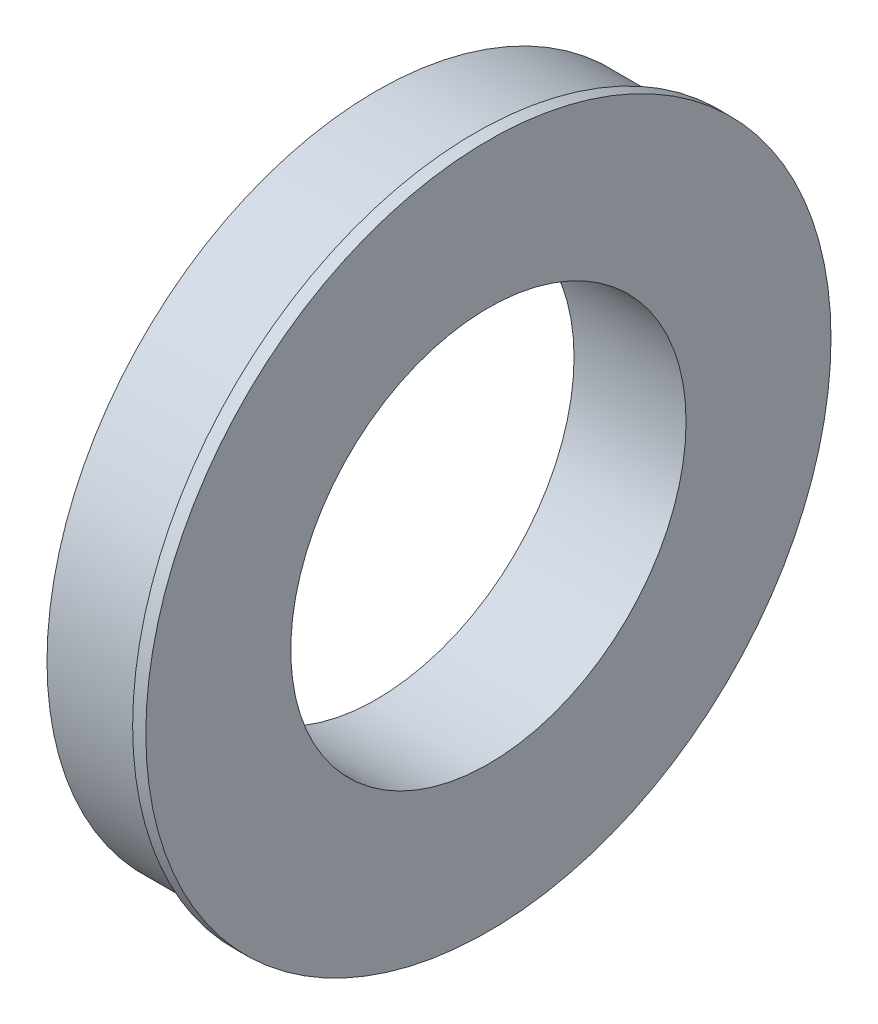
ISO-10303-21;
HEADER;
FILE_DESCRIPTION(('STEP AP214'),'2;1');
FILE_NAME('part.step','',(''),(''),'','','');
FILE_SCHEMA(('AUTOMOTIVE_DESIGN { 1 0 10303 214 1 1 1 1 }'));
ENDSEC;
DATA;
#1=APPLICATION_CONTEXT('core data for automotive mechanical design processes');
#2=APPLICATION_PROTOCOL_DEFINITION('international standard','automotive_design',2000,#1);
#3=PRODUCT_CONTEXT('',#1,'mechanical');
#4=PRODUCT('Part','Part','',(#3));
#5=PRODUCT_RELATED_PRODUCT_CATEGORY('part','',(#4));
#6=PRODUCT_DEFINITION_FORMATION('','',#4);
#7=PRODUCT_DEFINITION_CONTEXT('part definition',#1,'design');
#8=PRODUCT_DEFINITION('design','',#6,#7);
#9=PRODUCT_DEFINITION_SHAPE('','',#8);
#10=(LENGTH_UNIT() NAMED_UNIT(*) SI_UNIT(.MILLI.,.METRE.));
#11=(NAMED_UNIT(*) PLANE_ANGLE_UNIT() SI_UNIT($,.RADIAN.));
#12=(NAMED_UNIT(*) SI_UNIT($,.STERADIAN.) SOLID_ANGLE_UNIT());
#13=UNCERTAINTY_MEASURE_WITH_UNIT(LENGTH_MEASURE(1.E-05),#10,'distance_accuracy_value','');
#14=(GEOMETRIC_REPRESENTATION_CONTEXT(3) GLOBAL_UNCERTAINTY_ASSIGNED_CONTEXT((#13)) GLOBAL_UNIT_ASSIGNED_CONTEXT((#10,
#11,#12)) REPRESENTATION_CONTEXT('',''));
#15=CARTESIAN_POINT('',(0.,0.,0.));
#16=DIRECTION('',(0.,0.,1.));
#17=DIRECTION('',(1.,0.,0.));
#18=AXIS2_PLACEMENT_3D('',#15,#16,#17);
#19=CARTESIAN_POINT('',(0.,0.,0.));
#20=DIRECTION('',(1.,0.,0.));
#21=DIRECTION('',(0.,0.,-1.));
#22=AXIS2_PLACEMENT_3D('',#19,#20,#21);
#23=PLANE('',#22);
#24=CARTESIAN_POINT('',(0.,0.,0.));
#25=DIRECTION('',(1.,0.,0.));
#26=DIRECTION('',(0.,0.,-1.));
#27=AXIS2_PLACEMENT_3D('',#24,#25,#26);
#28=CIRCLE('',#27,63.5);
#29=CARTESIAN_POINT('',(0.,0.,-63.5));
#30=VERTEX_POINT('',#29);
#31=EDGE_CURVE('E45',#30,#30,#28,.T.);
#32=ORIENTED_EDGE('',*,*,#31,.F.);
#33=EDGE_LOOP('',(#32));
#34=FACE_BOUND('',#33,.T.);
#35=CARTESIAN_POINT('',(0.,0.,0.));
#36=DIRECTION('',(1.,0.,0.));
#37=DIRECTION('',(0.,0.,-1.));
#38=AXIS2_PLACEMENT_3D('',#35,#36,#37);
#39=CIRCLE('',#38,38.1);
#40=CARTESIAN_POINT('',(0.,0.,-38.1));
#41=VERTEX_POINT('',#40);
#42=EDGE_CURVE('E54',#41,#41,#39,.T.);
#43=ORIENTED_EDGE('',*,*,#42,.T.);
#44=EDGE_LOOP('',(#43));
#45=FACE_BOUND('',#44,.T.);
#46=ADVANCED_FACE('F41',(#34,#45),#23,.F.);
#47=CARTESIAN_POINT('',(19.05,0.,0.));
#48=DIRECTION('',(-1.,0.,0.));
#49=DIRECTION('',(0.,0.,1.));
#50=AXIS2_PLACEMENT_3D('',#47,#48,#49);
#51=CYLINDRICAL_SURFACE('',#50,63.5);
#52=CARTESIAN_POINT('',(19.05,0.,0.));
#53=DIRECTION('',(1.,0.,0.));
#54=DIRECTION('',(0.,0.,-1.));
#55=AXIS2_PLACEMENT_3D('',#52,#53,#54);
#56=CIRCLE('',#55,63.5);
#57=CARTESIAN_POINT('',(19.05,0.,-63.5));
#58=VERTEX_POINT('',#57);
#59=EDGE_CURVE('E10',#58,#58,#56,.T.);
#60=ORIENTED_EDGE('',*,*,#59,.F.);
#61=EDGE_LOOP('',(#60));
#62=FACE_BOUND('',#61,.T.);
#63=ORIENTED_EDGE('',*,*,#31,.T.);
#64=EDGE_LOOP('',(#63));
#65=FACE_BOUND('',#64,.T.);
#66=ADVANCED_FACE('F43',(#62,#65),#51,.T.);
#67=CARTESIAN_POINT('',(19.05,0.,0.));
#68=DIRECTION('',(-1.,0.,0.));
#69=DIRECTION('',(0.,0.,1.));
#70=AXIS2_PLACEMENT_3D('',#67,#68,#69);
#71=CYLINDRICAL_SURFACE('',#70,38.1);
#72=ORIENTED_EDGE('',*,*,#42,.F.);
#73=EDGE_LOOP('',(#72));
#74=FACE_BOUND('',#73,.T.);
#75=CARTESIAN_POINT('',(21.59,0.,0.));
#76=DIRECTION('',(1.,0.,0.));
#77=DIRECTION('',(0.,0.,-1.));
#78=AXIS2_PLACEMENT_3D('',#75,#76,#77);
#79=CIRCLE('',#78,38.1);
#80=CARTESIAN_POINT('',(21.59,0.,-38.1));
#81=VERTEX_POINT('',#80);
#82=EDGE_CURVE('E64',#81,#81,#79,.T.);
#83=ORIENTED_EDGE('',*,*,#82,.T.);
#84=EDGE_LOOP('',(#83));
#85=FACE_BOUND('',#84,.T.);
#86=ADVANCED_FACE('F72',(#74,#85),#71,.F.);
#87=CARTESIAN_POINT('',(21.59,0.,0.));
#88=DIRECTION('',(1.,0.,0.));
#89=DIRECTION('',(0.,0.,-1.));
#90=AXIS2_PLACEMENT_3D('',#87,#88,#89);
#91=PLANE('',#90);
#92=CARTESIAN_POINT('',(21.59,0.,0.));
#93=DIRECTION('',(1.,0.,0.));
#94=DIRECTION('',(0.,0.,-1.));
#95=AXIS2_PLACEMENT_3D('',#92,#93,#94);
#96=CIRCLE('',#95,66.04);
#97=CARTESIAN_POINT('',(21.59,0.,-66.04));
#98=VERTEX_POINT('',#97);
#99=EDGE_CURVE('E59',#98,#98,#96,.T.);
#100=ORIENTED_EDGE('',*,*,#99,.T.);
#101=EDGE_LOOP('',(#100));
#102=FACE_BOUND('',#101,.T.);
#103=ORIENTED_EDGE('',*,*,#82,.F.);
#104=EDGE_LOOP('',(#103));
#105=FACE_BOUND('',#104,.T.);
#106=ADVANCED_FACE('F74',(#102,#105),#91,.T.);
#107=CARTESIAN_POINT('',(19.05,0.,0.));
#108=DIRECTION('',(1.,0.,0.));
#109=DIRECTION('',(0.,0.,-1.));
#110=AXIS2_PLACEMENT_3D('',#107,#108,#109);
#111=PLANE('',#110);
#112=ORIENTED_EDGE('',*,*,#59,.T.);
#113=EDGE_LOOP('',(#112));
#114=FACE_BOUND('',#113,.T.);
#115=CARTESIAN_POINT('',(19.05,0.,0.));
#116=DIRECTION('',(1.,0.,0.));
#117=DIRECTION('',(0.,0.,-1.));
#118=AXIS2_PLACEMENT_3D('',#115,#116,#117);
#119=CIRCLE('',#118,66.04);
#120=CARTESIAN_POINT('',(19.05,0.,-66.04));
#121=VERTEX_POINT('',#120);
#122=EDGE_CURVE('E60',#121,#121,#119,.T.);
#123=ORIENTED_EDGE('',*,*,#122,.F.);
#124=EDGE_LOOP('',(#123));
#125=FACE_BOUND('',#124,.T.);
#126=ADVANCED_FACE('F76',(#114,#125),#111,.F.);
#127=CARTESIAN_POINT('',(21.59,0.,0.));
#128=DIRECTION('',(-1.,0.,0.));
#129=DIRECTION('',(0.,0.,1.));
#130=AXIS2_PLACEMENT_3D('',#127,#128,#129);
#131=CYLINDRICAL_SURFACE('',#130,66.04);
#132=ORIENTED_EDGE('',*,*,#99,.F.);
#133=EDGE_LOOP('',(#132));
#134=FACE_BOUND('',#133,.T.);
#135=ORIENTED_EDGE('',*,*,#122,.T.);
#136=EDGE_LOOP('',(#135));
#137=FACE_BOUND('',#136,.T.);
#138=ADVANCED_FACE('F83',(#134,#137),#131,.T.);
#139=CLOSED_SHELL('',(#46,#66,#86,#106,#126,#138));
#140=MANIFOLD_SOLID_BREP('B2',#139);
#141=ADVANCED_BREP_SHAPE_REPRESENTATION('',(#18,#140),#14);
#142=SHAPE_DEFINITION_REPRESENTATION(#9,#141);
ENDSEC;
END-ISO-10303-21;
